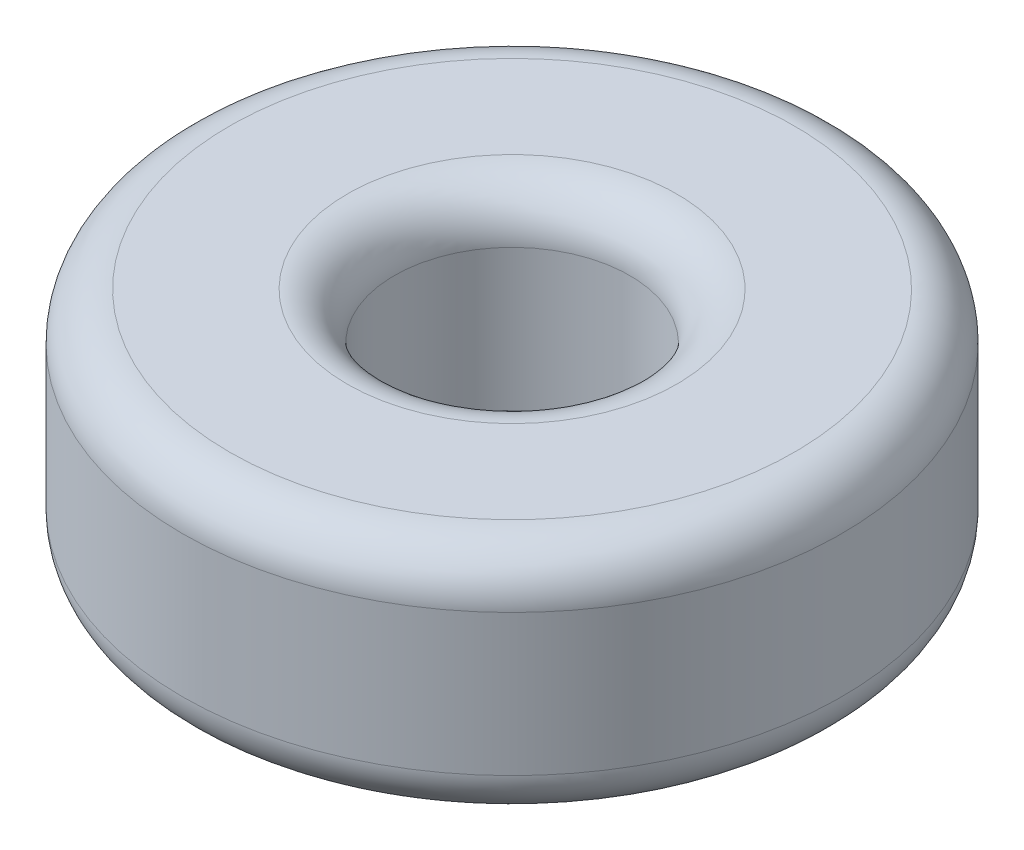
ISO-10303-21;
HEADER;
FILE_DESCRIPTION(('STEP AP214'),'2;1');
FILE_NAME('part.step','',(''),(''),'','','');
FILE_SCHEMA(('AUTOMOTIVE_DESIGN { 1 0 10303 214 1 1 1 1 }'));
ENDSEC;
DATA;
#1=APPLICATION_CONTEXT('core data for automotive mechanical design processes');
#2=APPLICATION_PROTOCOL_DEFINITION('international standard','automotive_design',2000,#1);
#3=PRODUCT_CONTEXT('',#1,'mechanical');
#4=PRODUCT('Part','Part','',(#3));
#5=PRODUCT_RELATED_PRODUCT_CATEGORY('part','',(#4));
#6=PRODUCT_DEFINITION_FORMATION('','',#4);
#7=PRODUCT_DEFINITION_CONTEXT('part definition',#1,'design');
#8=PRODUCT_DEFINITION('design','',#6,#7);
#9=PRODUCT_DEFINITION_SHAPE('','',#8);
#10=(LENGTH_UNIT() NAMED_UNIT(*) SI_UNIT(.MILLI.,.METRE.));
#11=(NAMED_UNIT(*) PLANE_ANGLE_UNIT() SI_UNIT($,.RADIAN.));
#12=(NAMED_UNIT(*) SI_UNIT($,.STERADIAN.) SOLID_ANGLE_UNIT());
#13=UNCERTAINTY_MEASURE_WITH_UNIT(LENGTH_MEASURE(1.E-05),#10,'distance_accuracy_value','');
#14=(GEOMETRIC_REPRESENTATION_CONTEXT(3) GLOBAL_UNCERTAINTY_ASSIGNED_CONTEXT((#13)) GLOBAL_UNIT_ASSIGNED_CONTEXT((#10,
#11,#12)) REPRESENTATION_CONTEXT('',''));
#15=CARTESIAN_POINT('',(0.,0.,0.));
#16=DIRECTION('',(0.,0.,1.));
#17=DIRECTION('',(1.,0.,0.));
#18=AXIS2_PLACEMENT_3D('',#15,#16,#17);
#19=CARTESIAN_POINT('',(0.,5.,0.));
#20=DIRECTION('',(0.,1.,0.));
#21=DIRECTION('',(0.,0.,1.));
#22=AXIS2_PLACEMENT_3D('',#19,#20,#21);
#23=PLANE('',#22);
#24=CARTESIAN_POINT('',(0.,5.,0.));
#25=DIRECTION('',(0.,1.,0.));
#26=DIRECTION('',(0.,0.,1.));
#27=AXIS2_PLACEMENT_3D('',#24,#25,#26);
#28=CIRCLE('',#27,3.5);
#29=CARTESIAN_POINT('',(0.,5.,3.5));
#30=VERTEX_POINT('',#29);
#31=EDGE_CURVE('E10',#30,#30,#28,.F.);
#32=ORIENTED_EDGE('',*,*,#31,.T.);
#33=EDGE_LOOP('',(#32));
#34=FACE_BOUND('',#33,.T.);
#35=CARTESIAN_POINT('',(0.,5.,0.));
#36=DIRECTION('',(0.,1.,0.));
#37=DIRECTION('',(0.,0.,1.));
#38=AXIS2_PLACEMENT_3D('',#35,#36,#37);
#39=CIRCLE('',#38,6.);
#40=CARTESIAN_POINT('',(0.,5.,6.));
#41=VERTEX_POINT('',#40);
#42=EDGE_CURVE('E54',#41,#41,#39,.T.);
#43=ORIENTED_EDGE('',*,*,#42,.T.);
#44=EDGE_LOOP('',(#43));
#45=FACE_BOUND('',#44,.T.);
#46=ADVANCED_FACE('F34',(#34,#45),#23,.T.);
#47=CARTESIAN_POINT('',(0.,0.,0.));
#48=DIRECTION('',(0.,1.,0.));
#49=DIRECTION('',(0.,0.,1.));
#50=AXIS2_PLACEMENT_3D('',#47,#48,#49);
#51=PLANE('',#50);
#52=CARTESIAN_POINT('',(0.,0.,0.));
#53=DIRECTION('',(0.,1.,0.));
#54=DIRECTION('',(0.,0.,1.));
#55=AXIS2_PLACEMENT_3D('',#52,#53,#54);
#56=CIRCLE('',#55,3.5);
#57=CARTESIAN_POINT('',(0.,0.,3.5));
#58=VERTEX_POINT('',#57);
#59=EDGE_CURVE('E49',#58,#58,#56,.T.);
#60=ORIENTED_EDGE('',*,*,#59,.T.);
#61=EDGE_LOOP('',(#60));
#62=FACE_BOUND('',#61,.T.);
#63=CARTESIAN_POINT('',(0.,0.,0.));
#64=DIRECTION('',(0.,1.,0.));
#65=DIRECTION('',(0.,0.,1.));
#66=AXIS2_PLACEMENT_3D('',#63,#64,#65);
#67=CIRCLE('',#66,6.);
#68=CARTESIAN_POINT('',(0.,0.,6.));
#69=VERTEX_POINT('',#68);
#70=EDGE_CURVE('E57',#69,#69,#67,.F.);
#71=ORIENTED_EDGE('',*,*,#70,.T.);
#72=EDGE_LOOP('',(#71));
#73=FACE_BOUND('',#72,.T.);
#74=ADVANCED_FACE('F78',(#62,#73),#51,.F.);
#75=CARTESIAN_POINT('',(0.,5.,0.));
#76=DIRECTION('',(0.,-1.,0.));
#77=DIRECTION('',(0.,0.,-1.));
#78=AXIS2_PLACEMENT_3D('',#75,#76,#77);
#79=CYLINDRICAL_SURFACE('',#78,7.);
#80=CARTESIAN_POINT('',(0.,1.,0.));
#81=DIRECTION('',(0.,1.,0.));
#82=DIRECTION('',(0.,0.,1.));
#83=AXIS2_PLACEMENT_3D('',#80,#81,#82);
#84=CIRCLE('',#83,7.);
#85=CARTESIAN_POINT('',(0.,1.,7.));
#86=VERTEX_POINT('',#85);
#87=EDGE_CURVE('E60',#86,#86,#84,.T.);
#88=ORIENTED_EDGE('',*,*,#87,.T.);
#89=EDGE_LOOP('',(#88));
#90=FACE_BOUND('',#89,.T.);
#91=CARTESIAN_POINT('',(0.,4.,0.));
#92=DIRECTION('',(0.,1.,0.));
#93=DIRECTION('',(0.,0.,1.));
#94=AXIS2_PLACEMENT_3D('',#91,#92,#93);
#95=CIRCLE('',#94,7.);
#96=CARTESIAN_POINT('',(0.,4.,7.));
#97=VERTEX_POINT('',#96);
#98=EDGE_CURVE('E63',#97,#97,#95,.F.);
#99=ORIENTED_EDGE('',*,*,#98,.T.);
#100=EDGE_LOOP('',(#99));
#101=FACE_BOUND('',#100,.T.);
#102=ADVANCED_FACE('F67',(#90,#101),#79,.T.);
#103=CARTESIAN_POINT('',(0.,5.,0.));
#104=DIRECTION('',(0.,-1.,0.));
#105=DIRECTION('',(0.,0.,-1.));
#106=AXIS2_PLACEMENT_3D('',#103,#104,#105);
#107=CYLINDRICAL_SURFACE('',#106,2.5);
#108=CARTESIAN_POINT('',(0.,1.,0.));
#109=DIRECTION('',(0.,1.,0.));
#110=DIRECTION('',(0.,0.,1.));
#111=AXIS2_PLACEMENT_3D('',#108,#109,#110);
#112=CIRCLE('',#111,2.5);
#113=CARTESIAN_POINT('',(0.,1.,2.5));
#114=VERTEX_POINT('',#113);
#115=EDGE_CURVE('E41',#114,#114,#112,.F.);
#116=ORIENTED_EDGE('',*,*,#115,.T.);
#117=EDGE_LOOP('',(#116));
#118=FACE_BOUND('',#117,.T.);
#119=CARTESIAN_POINT('',(0.,4.,0.));
#120=DIRECTION('',(0.,1.,0.));
#121=DIRECTION('',(0.,0.,1.));
#122=AXIS2_PLACEMENT_3D('',#119,#120,#121);
#123=CIRCLE('',#122,2.5);
#124=CARTESIAN_POINT('',(0.,4.,2.5));
#125=VERTEX_POINT('',#124);
#126=EDGE_CURVE('E45',#125,#125,#123,.T.);
#127=ORIENTED_EDGE('',*,*,#126,.T.);
#128=EDGE_LOOP('',(#127));
#129=FACE_BOUND('',#128,.T.);
#130=ADVANCED_FACE('F86',(#118,#129),#107,.F.);
#131=CARTESIAN_POINT('',(0.,1.,0.));
#132=DIRECTION('',(0.,1.,0.));
#133=DIRECTION('',(0.,0.,1.));
#134=AXIS2_PLACEMENT_3D('',#131,#132,#133);
#135=TOROIDAL_SURFACE('',#134,6.,1.);
#136=ORIENTED_EDGE('',*,*,#70,.F.);
#137=EDGE_LOOP('',(#136));
#138=FACE_BOUND('',#137,.T.);
#139=ORIENTED_EDGE('',*,*,#87,.F.);
#140=EDGE_LOOP('',(#139));
#141=FACE_BOUND('',#140,.T.);
#142=ADVANCED_FACE('F73',(#138,#141),#135,.T.);
#143=CARTESIAN_POINT('',(0.,4.,0.));
#144=DIRECTION('',(0.,1.,0.));
#145=DIRECTION('',(0.,0.,1.));
#146=AXIS2_PLACEMENT_3D('',#143,#144,#145);
#147=TOROIDAL_SURFACE('',#146,6.,1.);
#148=ORIENTED_EDGE('',*,*,#98,.F.);
#149=EDGE_LOOP('',(#148));
#150=FACE_BOUND('',#149,.T.);
#151=ORIENTED_EDGE('',*,*,#42,.F.);
#152=EDGE_LOOP('',(#151));
#153=FACE_BOUND('',#152,.T.);
#154=ADVANCED_FACE('F69',(#150,#153),#147,.T.);
#155=CARTESIAN_POINT('',(0.,1.,0.));
#156=DIRECTION('',(0.,1.,0.));
#157=DIRECTION('',(0.,0.,1.));
#158=AXIS2_PLACEMENT_3D('',#155,#156,#157);
#159=TOROIDAL_SURFACE('',#158,3.5,1.);
#160=ORIENTED_EDGE('',*,*,#115,.F.);
#161=EDGE_LOOP('',(#160));
#162=FACE_BOUND('',#161,.T.);
#163=ORIENTED_EDGE('',*,*,#59,.F.);
#164=EDGE_LOOP('',(#163));
#165=FACE_BOUND('',#164,.T.);
#166=ADVANCED_FACE('F72',(#162,#165),#159,.T.);
#167=CARTESIAN_POINT('',(0.,4.,0.));
#168=DIRECTION('',(0.,1.,0.));
#169=DIRECTION('',(0.,0.,1.));
#170=AXIS2_PLACEMENT_3D('',#167,#168,#169);
#171=TOROIDAL_SURFACE('',#170,3.5,1.);
#172=ORIENTED_EDGE('',*,*,#31,.F.);
#173=EDGE_LOOP('',(#172));
#174=FACE_BOUND('',#173,.T.);
#175=ORIENTED_EDGE('',*,*,#126,.F.);
#176=EDGE_LOOP('',(#175));
#177=FACE_BOUND('',#176,.T.);
#178=ADVANCED_FACE('F36',(#174,#177),#171,.T.);
#179=CLOSED_SHELL('',(#46,#74,#102,#130,#142,#154,#166,#178));
#180=MANIFOLD_SOLID_BREP('B2',#179);
#181=ADVANCED_BREP_SHAPE_REPRESENTATION('',(#18,#180),#14);
#182=SHAPE_DEFINITION_REPRESENTATION(#9,#181);
ENDSEC;
END-ISO-10303-21;
